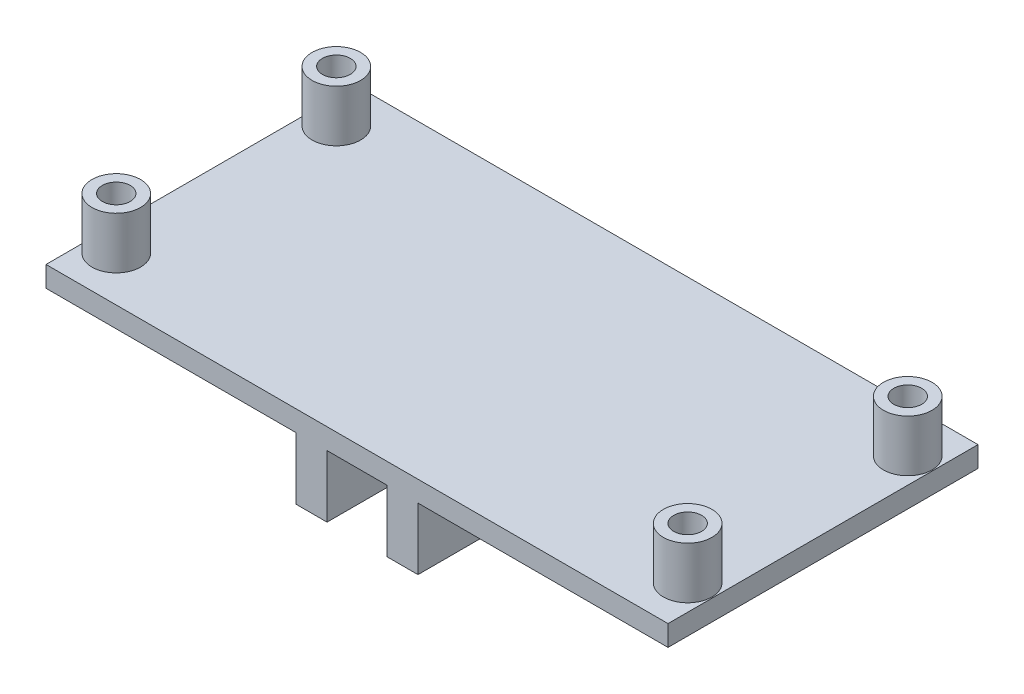
ISO-10303-21;
HEADER;
FILE_DESCRIPTION(('STEP AP214'),'2;1');
FILE_NAME('part.step','',(''),(''),'','','');
FILE_SCHEMA(('AUTOMOTIVE_DESIGN { 1 0 10303 214 1 1 1 1 }'));
ENDSEC;
DATA;
#1=APPLICATION_CONTEXT('core data for automotive mechanical design processes');
#2=APPLICATION_PROTOCOL_DEFINITION('international standard','automotive_design',2000,#1);
#3=PRODUCT_CONTEXT('',#1,'mechanical');
#4=PRODUCT('Part','Part','',(#3));
#5=PRODUCT_RELATED_PRODUCT_CATEGORY('part','',(#4));
#6=PRODUCT_DEFINITION_FORMATION('','',#4);
#7=PRODUCT_DEFINITION_CONTEXT('part definition',#1,'design');
#8=PRODUCT_DEFINITION('design','',#6,#7);
#9=PRODUCT_DEFINITION_SHAPE('','',#8);
#10=(LENGTH_UNIT() NAMED_UNIT(*) SI_UNIT(.MILLI.,.METRE.));
#11=(NAMED_UNIT(*) PLANE_ANGLE_UNIT() SI_UNIT($,.RADIAN.));
#12=(NAMED_UNIT(*) SI_UNIT($,.STERADIAN.) SOLID_ANGLE_UNIT());
#13=UNCERTAINTY_MEASURE_WITH_UNIT(LENGTH_MEASURE(1.E-05),#10,'distance_accuracy_value','');
#14=(GEOMETRIC_REPRESENTATION_CONTEXT(3) GLOBAL_UNCERTAINTY_ASSIGNED_CONTEXT((#13)) GLOBAL_UNIT_ASSIGNED_CONTEXT((#10,
#11,#12)) REPRESENTATION_CONTEXT('',''));
#15=CARTESIAN_POINT('',(0.,0.,0.));
#16=DIRECTION('',(0.,0.,1.));
#17=DIRECTION('',(1.,0.,0.));
#18=AXIS2_PLACEMENT_3D('',#15,#16,#17);
#19=CARTESIAN_POINT('',(0.,0.,0.));
#20=DIRECTION('',(0.,1.,0.));
#21=DIRECTION('',(0.,0.,1.));
#22=AXIS2_PLACEMENT_3D('',#19,#20,#21);
#23=PLANE('',#22);
#24=CARTESIAN_POINT('',(-27.65,0.,10.65));
#25=DIRECTION('',(0.,1.,0.));
#26=DIRECTION('',(0.,0.,-1.));
#27=AXIS2_PLACEMENT_3D('',#24,#25,#26);
#28=CIRCLE('',#27,1.35);
#29=CARTESIAN_POINT('',(-27.65,0.,9.3));
#30=VERTEX_POINT('',#29);
#31=EDGE_CURVE('E247',#30,#30,#28,.T.);
#32=ORIENTED_EDGE('',*,*,#31,.T.);
#33=EDGE_LOOP('',(#32));
#34=FACE_BOUND('',#33,.T.);
#35=CARTESIAN_POINT('',(-27.65,0.,-10.65));
#36=DIRECTION('',(0.,1.,0.));
#37=DIRECTION('',(0.,0.,1.));
#38=AXIS2_PLACEMENT_3D('',#35,#36,#37);
#39=CIRCLE('',#38,1.35);
#40=CARTESIAN_POINT('',(-27.65,0.,-9.3));
#41=VERTEX_POINT('',#40);
#42=EDGE_CURVE('E251',#41,#41,#39,.T.);
#43=ORIENTED_EDGE('',*,*,#42,.T.);
#44=EDGE_LOOP('',(#43));
#45=FACE_BOUND('',#44,.T.);
#46=DIRECTION('',(0.,0.,-1.));
#47=VECTOR('',#46,1.);
#48=CARTESIAN_POINT('',(-5.9,0.,-15.));
#49=LINE('',#48,#47);
#50=CARTESIAN_POINT('',(-5.9,0.,15.));
#51=VERTEX_POINT('',#50);
#52=CARTESIAN_POINT('',(-5.9,0.,-15.));
#53=VERTEX_POINT('',#52);
#54=EDGE_CURVE('E155',#51,#53,#49,.T.);
#55=ORIENTED_EDGE('',*,*,#54,.F.);
#56=DIRECTION('',(1.,0.,0.));
#57=VECTOR('',#56,1.);
#58=CARTESIAN_POINT('',(-30.1,0.,15.));
#59=LINE('',#58,#57);
#60=CARTESIAN_POINT('',(-30.1,0.,15.));
#61=VERTEX_POINT('',#60);
#62=EDGE_CURVE('E268',#61,#51,#59,.T.);
#63=ORIENTED_EDGE('',*,*,#62,.F.);
#64=DIRECTION('',(0.,0.,1.));
#65=VECTOR('',#64,1.);
#66=CARTESIAN_POINT('',(-30.1,0.,-15.));
#67=LINE('',#66,#65);
#68=CARTESIAN_POINT('',(-30.1,0.,-15.));
#69=VERTEX_POINT('',#68);
#70=EDGE_CURVE('E285',#69,#61,#67,.T.);
#71=ORIENTED_EDGE('',*,*,#70,.F.);
#72=DIRECTION('',(-1.,0.,0.));
#73=VECTOR('',#72,1.);
#74=CARTESIAN_POINT('',(-30.1,0.,-15.));
#75=LINE('',#74,#73);
#76=EDGE_CURVE('E281',#53,#69,#75,.T.);
#77=ORIENTED_EDGE('',*,*,#76,.F.);
#78=EDGE_LOOP('',(#55,#63,#71,#77));
#79=FACE_BOUND('',#78,.T.);
#80=ADVANCED_FACE('F39',(#34,#45,#79),#23,.F.);
#81=DIRECTION('',(0.,0.,1.));
#82=VECTOR('',#81,1.);
#83=CARTESIAN_POINT('',(-2.9,0.,-15.));
#84=LINE('',#83,#82);
#85=CARTESIAN_POINT('',(-2.9,0.,-15.));
#86=VERTEX_POINT('',#85);
#87=CARTESIAN_POINT('',(-2.90000000000001,0.,15.));
#88=VERTEX_POINT('',#87);
#89=EDGE_CURVE('E151',#86,#88,#84,.T.);
#90=ORIENTED_EDGE('',*,*,#89,.F.);
#91=CARTESIAN_POINT('',(2.9,0.,-15.));
#92=VERTEX_POINT('',#91);
#93=EDGE_CURVE('E286',#92,#86,#75,.T.);
#94=ORIENTED_EDGE('',*,*,#93,.F.);
#95=DIRECTION('',(0.,0.,-1.));
#96=VECTOR('',#95,1.);
#97=CARTESIAN_POINT('',(2.9,0.,-15.));
#98=LINE('',#97,#96);
#99=CARTESIAN_POINT('',(2.89999999999999,0.,15.));
#100=VERTEX_POINT('',#99);
#101=EDGE_CURVE('E161',#100,#92,#98,.T.);
#102=ORIENTED_EDGE('',*,*,#101,.F.);
#103=EDGE_CURVE('E293',#88,#100,#59,.T.);
#104=ORIENTED_EDGE('',*,*,#103,.F.);
#105=EDGE_LOOP('',(#90,#94,#102,#104));
#106=FACE_BOUND('',#105,.T.);
#107=ADVANCED_FACE('F368',(#106),#23,.F.);
#108=CARTESIAN_POINT('',(27.65,0.,10.65));
#109=DIRECTION('',(0.,1.,0.));
#110=DIRECTION('',(0.,0.,1.));
#111=AXIS2_PLACEMENT_3D('',#108,#109,#110);
#112=CIRCLE('',#111,1.35);
#113=CARTESIAN_POINT('',(27.65,0.,12.));
#114=VERTEX_POINT('',#113);
#115=EDGE_CURVE('E252',#114,#114,#112,.T.);
#116=ORIENTED_EDGE('',*,*,#115,.T.);
#117=EDGE_LOOP('',(#116));
#118=FACE_BOUND('',#117,.T.);
#119=CARTESIAN_POINT('',(27.65,0.,-10.65));
#120=DIRECTION('',(0.,1.,0.));
#121=DIRECTION('',(0.,0.,-1.));
#122=AXIS2_PLACEMENT_3D('',#119,#120,#121);
#123=CIRCLE('',#122,1.35);
#124=CARTESIAN_POINT('',(27.65,0.,-12.));
#125=VERTEX_POINT('',#124);
#126=EDGE_CURVE('E243',#125,#125,#123,.T.);
#127=ORIENTED_EDGE('',*,*,#126,.T.);
#128=EDGE_LOOP('',(#127));
#129=FACE_BOUND('',#128,.T.);
#130=DIRECTION('',(0.,0.,1.));
#131=VECTOR('',#130,1.);
#132=CARTESIAN_POINT('',(5.9,0.,-15.));
#133=LINE('',#132,#131);
#134=CARTESIAN_POINT('',(5.89999999999999,0.,-15.));
#135=VERTEX_POINT('',#134);
#136=CARTESIAN_POINT('',(5.89999999999999,0.,15.));
#137=VERTEX_POINT('',#136);
#138=EDGE_CURVE('E65',#135,#137,#133,.T.);
#139=ORIENTED_EDGE('',*,*,#138,.F.);
#140=CARTESIAN_POINT('',(30.1,0.,-15.));
#141=VERTEX_POINT('',#140);
#142=EDGE_CURVE('E282',#141,#135,#75,.T.);
#143=ORIENTED_EDGE('',*,*,#142,.F.);
#144=DIRECTION('',(0.,0.,-1.));
#145=VECTOR('',#144,1.);
#146=CARTESIAN_POINT('',(30.1,0.,-15.));
#147=LINE('',#146,#145);
#148=CARTESIAN_POINT('',(30.1,0.,15.));
#149=VERTEX_POINT('',#148);
#150=EDGE_CURVE('E262',#149,#141,#147,.T.);
#151=ORIENTED_EDGE('',*,*,#150,.F.);
#152=EDGE_CURVE('E289',#137,#149,#59,.T.);
#153=ORIENTED_EDGE('',*,*,#152,.F.);
#154=EDGE_LOOP('',(#139,#143,#151,#153));
#155=FACE_BOUND('',#154,.T.);
#156=ADVANCED_FACE('F371',(#118,#129,#155),#23,.F.);
#157=CARTESIAN_POINT('',(0.,2.,0.));
#158=DIRECTION('',(0.,1.,0.));
#159=DIRECTION('',(0.,0.,1.));
#160=AXIS2_PLACEMENT_3D('',#157,#158,#159);
#161=PLANE('',#160);
#162=CARTESIAN_POINT('',(27.65,2.,10.65));
#163=DIRECTION('',(0.,1.,0.));
#164=DIRECTION('',(0.,0.,1.));
#165=AXIS2_PLACEMENT_3D('',#162,#163,#164);
#166=CIRCLE('',#165,2.35);
#167=CARTESIAN_POINT('',(27.65,2.,13.));
#168=VERTEX_POINT('',#167);
#169=EDGE_CURVE('E214',#168,#168,#166,.T.);
#170=ORIENTED_EDGE('',*,*,#169,.F.);
#171=EDGE_LOOP('',(#170));
#172=FACE_BOUND('',#171,.T.);
#173=CARTESIAN_POINT('',(-27.65,2.,-10.65));
#174=DIRECTION('',(0.,1.,0.));
#175=DIRECTION('',(0.,0.,1.));
#176=AXIS2_PLACEMENT_3D('',#173,#174,#175);
#177=CIRCLE('',#176,2.35);
#178=CARTESIAN_POINT('',(-27.65,2.,-8.3));
#179=VERTEX_POINT('',#178);
#180=EDGE_CURVE('E238',#179,#179,#177,.T.);
#181=ORIENTED_EDGE('',*,*,#180,.F.);
#182=EDGE_LOOP('',(#181));
#183=FACE_BOUND('',#182,.T.);
#184=DIRECTION('',(0.,0.,-1.));
#185=VECTOR('',#184,1.);
#186=CARTESIAN_POINT('',(30.1,2.,-15.));
#187=LINE('',#186,#185);
#188=CARTESIAN_POINT('',(30.1,2.,15.));
#189=VERTEX_POINT('',#188);
#190=CARTESIAN_POINT('',(30.1,2.,-15.));
#191=VERTEX_POINT('',#190);
#192=EDGE_CURVE('E263',#189,#191,#187,.T.);
#193=ORIENTED_EDGE('',*,*,#192,.T.);
#194=DIRECTION('',(-1.,0.,0.));
#195=VECTOR('',#194,1.);
#196=CARTESIAN_POINT('',(-30.1,2.,-15.));
#197=LINE('',#196,#195);
#198=CARTESIAN_POINT('',(-30.1,2.,-15.));
#199=VERTEX_POINT('',#198);
#200=EDGE_CURVE('E267',#191,#199,#197,.T.);
#201=ORIENTED_EDGE('',*,*,#200,.T.);
#202=DIRECTION('',(0.,0.,1.));
#203=VECTOR('',#202,1.);
#204=CARTESIAN_POINT('',(-30.1,2.,-15.));
#205=LINE('',#204,#203);
#206=CARTESIAN_POINT('',(-30.1,2.,15.));
#207=VERTEX_POINT('',#206);
#208=EDGE_CURVE('E271',#199,#207,#205,.T.);
#209=ORIENTED_EDGE('',*,*,#208,.T.);
#210=DIRECTION('',(1.,0.,0.));
#211=VECTOR('',#210,1.);
#212=CARTESIAN_POINT('',(-30.1,2.,15.));
#213=LINE('',#212,#211);
#214=EDGE_CURVE('E274',#207,#189,#213,.T.);
#215=ORIENTED_EDGE('',*,*,#214,.T.);
#216=EDGE_LOOP('',(#193,#201,#209,#215));
#217=FACE_BOUND('',#216,.T.);
#218=CARTESIAN_POINT('',(27.65,2.,-10.65));
#219=DIRECTION('',(0.,1.,0.));
#220=DIRECTION('',(0.,0.,1.));
#221=AXIS2_PLACEMENT_3D('',#218,#219,#220);
#222=CIRCLE('',#221,2.35);
#223=CARTESIAN_POINT('',(27.65,2.,-8.30000000000001));
#224=VERTEX_POINT('',#223);
#225=EDGE_CURVE('E226',#224,#224,#222,.T.);
#226=ORIENTED_EDGE('',*,*,#225,.F.);
#227=EDGE_LOOP('',(#226));
#228=FACE_BOUND('',#227,.T.);
#229=CARTESIAN_POINT('',(-27.65,2.,10.65));
#230=DIRECTION('',(0.,1.,0.));
#231=DIRECTION('',(0.,0.,1.));
#232=AXIS2_PLACEMENT_3D('',#229,#230,#231);
#233=CIRCLE('',#232,2.35);
#234=CARTESIAN_POINT('',(-27.65,2.,13.));
#235=VERTEX_POINT('',#234);
#236=EDGE_CURVE('E202',#235,#235,#233,.T.);
#237=ORIENTED_EDGE('',*,*,#236,.F.);
#238=EDGE_LOOP('',(#237));
#239=FACE_BOUND('',#238,.T.);
#240=ADVANCED_FACE('F380',(#172,#183,#217,#228,#239),#161,.T.);
#241=CARTESIAN_POINT('',(30.1,2.,-15.));
#242=DIRECTION('',(-1.,0.,0.));
#243=DIRECTION('',(0.,0.,1.));
#244=AXIS2_PLACEMENT_3D('',#241,#242,#243);
#245=PLANE('',#244);
#246=ORIENTED_EDGE('',*,*,#150,.T.);
#247=DIRECTION('',(0.,-1.,0.));
#248=VECTOR('',#247,1.);
#249=CARTESIAN_POINT('',(30.1,2.,-15.));
#250=LINE('',#249,#248);
#251=EDGE_CURVE('E11',#191,#141,#250,.T.);
#252=ORIENTED_EDGE('',*,*,#251,.F.);
#253=ORIENTED_EDGE('',*,*,#192,.F.);
#254=DIRECTION('',(0.,-1.,0.));
#255=VECTOR('',#254,1.);
#256=CARTESIAN_POINT('',(30.1,2.,15.));
#257=LINE('',#256,#255);
#258=EDGE_CURVE('E277',#189,#149,#257,.T.);
#259=ORIENTED_EDGE('',*,*,#258,.T.);
#260=EDGE_LOOP('',(#246,#252,#253,#259));
#261=FACE_BOUND('',#260,.T.);
#262=ADVANCED_FACE('F41',(#261),#245,.F.);
#263=CARTESIAN_POINT('',(-30.1,2.,-15.));
#264=DIRECTION('',(0.,0.,1.));
#265=DIRECTION('',(1.,0.,0.));
#266=AXIS2_PLACEMENT_3D('',#263,#264,#265);
#267=PLANE('',#266);
#268=ORIENTED_EDGE('',*,*,#142,.T.);
#269=DIRECTION('',(0.,1.,0.));
#270=VECTOR('',#269,1.);
#271=CARTESIAN_POINT('',(5.9,-6.,-15.));
#272=LINE('',#271,#270);
#273=CARTESIAN_POINT('',(5.9,-6.,-15.));
#274=VERTEX_POINT('',#273);
#275=EDGE_CURVE('E178',#274,#135,#272,.T.);
#276=ORIENTED_EDGE('',*,*,#275,.F.);
#277=DIRECTION('',(1.,0.,0.));
#278=VECTOR('',#277,1.);
#279=CARTESIAN_POINT('',(5.9,-6.,-15.));
#280=LINE('',#279,#278);
#281=CARTESIAN_POINT('',(2.9,-6.,-15.));
#282=VERTEX_POINT('',#281);
#283=EDGE_CURVE('E176',#282,#274,#280,.T.);
#284=ORIENTED_EDGE('',*,*,#283,.F.);
#285=DIRECTION('',(0.,1.,0.));
#286=VECTOR('',#285,1.);
#287=CARTESIAN_POINT('',(2.9,-6.,-15.));
#288=LINE('',#287,#286);
#289=EDGE_CURVE('E186',#282,#92,#288,.T.);
#290=ORIENTED_EDGE('',*,*,#289,.T.);
#291=ORIENTED_EDGE('',*,*,#93,.T.);
#292=DIRECTION('',(0.,1.,0.));
#293=VECTOR('',#292,1.);
#294=CARTESIAN_POINT('',(-2.9,-6.,-15.));
#295=LINE('',#294,#293);
#296=CARTESIAN_POINT('',(-2.9,-6.,-15.));
#297=VERTEX_POINT('',#296);
#298=EDGE_CURVE('E138',#297,#86,#295,.T.);
#299=ORIENTED_EDGE('',*,*,#298,.F.);
#300=DIRECTION('',(1.,0.,0.));
#301=VECTOR('',#300,1.);
#302=CARTESIAN_POINT('',(-5.9,-6.,-15.));
#303=LINE('',#302,#301);
#304=CARTESIAN_POINT('',(-5.9,-6.,-15.));
#305=VERTEX_POINT('',#304);
#306=EDGE_CURVE('E131',#305,#297,#303,.T.);
#307=ORIENTED_EDGE('',*,*,#306,.F.);
#308=DIRECTION('',(0.,1.,0.));
#309=VECTOR('',#308,1.);
#310=CARTESIAN_POINT('',(-5.9,-6.,-15.));
#311=LINE('',#310,#309);
#312=EDGE_CURVE('E135',#305,#53,#311,.T.);
#313=ORIENTED_EDGE('',*,*,#312,.T.);
#314=ORIENTED_EDGE('',*,*,#76,.T.);
#315=DIRECTION('',(0.,-1.,0.));
#316=VECTOR('',#315,1.);
#317=CARTESIAN_POINT('',(-30.1,2.,-15.));
#318=LINE('',#317,#316);
#319=EDGE_CURVE('E49',#199,#69,#318,.T.);
#320=ORIENTED_EDGE('',*,*,#319,.F.);
#321=ORIENTED_EDGE('',*,*,#200,.F.);
#322=ORIENTED_EDGE('',*,*,#251,.T.);
#323=EDGE_LOOP('',(#268,#276,#284,#290,#291,#299,#307,#313,#314,#320,#321,#322));
#324=FACE_BOUND('',#323,.T.);
#325=ADVANCED_FACE('F133',(#324),#267,.F.);
#326=CARTESIAN_POINT('',(-30.1,2.,-15.));
#327=DIRECTION('',(1.,0.,0.));
#328=DIRECTION('',(0.,0.,-1.));
#329=AXIS2_PLACEMENT_3D('',#326,#327,#328);
#330=PLANE('',#329);
#331=ORIENTED_EDGE('',*,*,#70,.T.);
#332=DIRECTION('',(0.,-1.,0.));
#333=VECTOR('',#332,1.);
#334=CARTESIAN_POINT('',(-30.1,2.,15.));
#335=LINE('',#334,#333);
#336=EDGE_CURVE('E297',#207,#61,#335,.T.);
#337=ORIENTED_EDGE('',*,*,#336,.F.);
#338=ORIENTED_EDGE('',*,*,#208,.F.);
#339=ORIENTED_EDGE('',*,*,#319,.T.);
#340=EDGE_LOOP('',(#331,#337,#338,#339));
#341=FACE_BOUND('',#340,.T.);
#342=ADVANCED_FACE('F434',(#341),#330,.F.);
#343=CARTESIAN_POINT('',(-30.1,2.,15.));
#344=DIRECTION('',(0.,0.,-1.));
#345=DIRECTION('',(-1.,0.,0.));
#346=AXIS2_PLACEMENT_3D('',#343,#344,#345);
#347=PLANE('',#346);
#348=ORIENTED_EDGE('',*,*,#62,.T.);
#349=DIRECTION('',(0.,1.,0.));
#350=VECTOR('',#349,1.);
#351=CARTESIAN_POINT('',(-5.9,-6.,15.));
#352=LINE('',#351,#350);
#353=CARTESIAN_POINT('',(-5.9,-6.,15.));
#354=VERTEX_POINT('',#353);
#355=EDGE_CURVE('E339',#354,#51,#352,.T.);
#356=ORIENTED_EDGE('',*,*,#355,.F.);
#357=DIRECTION('',(-1.,0.,0.));
#358=VECTOR('',#357,1.);
#359=CARTESIAN_POINT('',(-5.9,-6.,15.));
#360=LINE('',#359,#358);
#361=CARTESIAN_POINT('',(-2.9,-6.,15.));
#362=VERTEX_POINT('',#361);
#363=EDGE_CURVE('E147',#362,#354,#360,.T.);
#364=ORIENTED_EDGE('',*,*,#363,.F.);
#365=DIRECTION('',(0.,1.,0.));
#366=VECTOR('',#365,1.);
#367=CARTESIAN_POINT('',(-2.9,-6.,15.));
#368=LINE('',#367,#366);
#369=EDGE_CURVE('E57',#362,#88,#368,.T.);
#370=ORIENTED_EDGE('',*,*,#369,.T.);
#371=ORIENTED_EDGE('',*,*,#103,.T.);
#372=DIRECTION('',(0.,1.,0.));
#373=VECTOR('',#372,1.);
#374=CARTESIAN_POINT('',(2.9,-6.,15.));
#375=LINE('',#374,#373);
#376=CARTESIAN_POINT('',(2.9,-6.,15.));
#377=VERTEX_POINT('',#376);
#378=EDGE_CURVE('E190',#377,#100,#375,.T.);
#379=ORIENTED_EDGE('',*,*,#378,.F.);
#380=DIRECTION('',(-1.,0.,0.));
#381=VECTOR('',#380,1.);
#382=CARTESIAN_POINT('',(5.9,-6.,15.));
#383=LINE('',#382,#381);
#384=CARTESIAN_POINT('',(5.9,-6.,15.));
#385=VERTEX_POINT('',#384);
#386=EDGE_CURVE('E170',#385,#377,#383,.T.);
#387=ORIENTED_EDGE('',*,*,#386,.F.);
#388=DIRECTION('',(0.,1.,0.));
#389=VECTOR('',#388,1.);
#390=CARTESIAN_POINT('',(5.9,-6.,15.));
#391=LINE('',#390,#389);
#392=EDGE_CURVE('E194',#385,#137,#391,.T.);
#393=ORIENTED_EDGE('',*,*,#392,.T.);
#394=ORIENTED_EDGE('',*,*,#152,.T.);
#395=ORIENTED_EDGE('',*,*,#258,.F.);
#396=ORIENTED_EDGE('',*,*,#214,.F.);
#397=ORIENTED_EDGE('',*,*,#336,.T.);
#398=EDGE_LOOP('',(#348,#356,#364,#370,#371,#379,#387,#393,#394,#395,#396,#397));
#399=FACE_BOUND('',#398,.T.);
#400=ADVANCED_FACE('F429',(#399),#347,.F.);
#401=CARTESIAN_POINT('',(-27.65,0.,-10.65));
#402=DIRECTION('',(0.,1.,0.));
#403=DIRECTION('',(0.,0.,1.));
#404=AXIS2_PLACEMENT_3D('',#401,#402,#403);
#405=CYLINDRICAL_SURFACE('',#404,1.35);
#406=ORIENTED_EDGE('',*,*,#42,.F.);
#407=EDGE_LOOP('',(#406));
#408=FACE_BOUND('',#407,.T.);
#409=CARTESIAN_POINT('',(-27.65,7.,-10.65));
#410=DIRECTION('',(0.,1.,0.));
#411=DIRECTION('',(0.,0.,1.));
#412=AXIS2_PLACEMENT_3D('',#409,#410,#411);
#413=CIRCLE('',#412,1.35);
#414=CARTESIAN_POINT('',(-27.65,7.,-9.3));
#415=VERTEX_POINT('',#414);
#416=EDGE_CURVE('E231',#415,#415,#413,.T.);
#417=ORIENTED_EDGE('',*,*,#416,.T.);
#418=EDGE_LOOP('',(#417));
#419=FACE_BOUND('',#418,.T.);
#420=ADVANCED_FACE('F423',(#408,#419),#405,.F.);
#421=CARTESIAN_POINT('',(-27.65,0.,10.65));
#422=DIRECTION('',(0.,1.,0.));
#423=DIRECTION('',(0.,0.,1.));
#424=AXIS2_PLACEMENT_3D('',#421,#422,#423);
#425=CYLINDRICAL_SURFACE('',#424,1.35);
#426=ORIENTED_EDGE('',*,*,#31,.F.);
#427=EDGE_LOOP('',(#426));
#428=FACE_BOUND('',#427,.T.);
#429=CARTESIAN_POINT('',(-27.65,7.,10.65));
#430=DIRECTION('',(0.,1.,0.));
#431=DIRECTION('',(0.,0.,1.));
#432=AXIS2_PLACEMENT_3D('',#429,#430,#431);
#433=CIRCLE('',#432,1.35);
#434=CARTESIAN_POINT('',(-27.65,7.,12.));
#435=VERTEX_POINT('',#434);
#436=EDGE_CURVE('E198',#435,#435,#433,.T.);
#437=ORIENTED_EDGE('',*,*,#436,.T.);
#438=EDGE_LOOP('',(#437));
#439=FACE_BOUND('',#438,.T.);
#440=ADVANCED_FACE('F420',(#428,#439),#425,.F.);
#441=CARTESIAN_POINT('',(27.65,0.,10.65));
#442=DIRECTION('',(0.,1.,0.));
#443=DIRECTION('',(0.,0.,1.));
#444=AXIS2_PLACEMENT_3D('',#441,#442,#443);
#445=CYLINDRICAL_SURFACE('',#444,1.35);
#446=ORIENTED_EDGE('',*,*,#115,.F.);
#447=EDGE_LOOP('',(#446));
#448=FACE_BOUND('',#447,.T.);
#449=CARTESIAN_POINT('',(27.65,7.,10.65));
#450=DIRECTION('',(0.,1.,0.));
#451=DIRECTION('',(0.,0.,1.));
#452=AXIS2_PLACEMENT_3D('',#449,#450,#451);
#453=CIRCLE('',#452,1.35);
#454=CARTESIAN_POINT('',(27.65,7.,12.));
#455=VERTEX_POINT('',#454);
#456=EDGE_CURVE('E207',#455,#455,#453,.T.);
#457=ORIENTED_EDGE('',*,*,#456,.T.);
#458=EDGE_LOOP('',(#457));
#459=FACE_BOUND('',#458,.T.);
#460=ADVANCED_FACE('F394',(#448,#459),#445,.F.);
#461=CARTESIAN_POINT('',(27.65,0.,-10.65));
#462=DIRECTION('',(0.,1.,0.));
#463=DIRECTION('',(0.,0.,1.));
#464=AXIS2_PLACEMENT_3D('',#461,#462,#463);
#465=CYLINDRICAL_SURFACE('',#464,1.35);
#466=ORIENTED_EDGE('',*,*,#126,.F.);
#467=EDGE_LOOP('',(#466));
#468=FACE_BOUND('',#467,.T.);
#469=CARTESIAN_POINT('',(27.65,7.,-10.65));
#470=DIRECTION('',(0.,1.,0.));
#471=DIRECTION('',(0.,0.,1.));
#472=AXIS2_PLACEMENT_3D('',#469,#470,#471);
#473=CIRCLE('',#472,1.35);
#474=CARTESIAN_POINT('',(27.65,7.,-9.30000000000001));
#475=VERTEX_POINT('',#474);
#476=EDGE_CURVE('E219',#475,#475,#473,.T.);
#477=ORIENTED_EDGE('',*,*,#476,.T.);
#478=EDGE_LOOP('',(#477));
#479=FACE_BOUND('',#478,.T.);
#480=ADVANCED_FACE('F390',(#468,#479),#465,.F.);
#481=CARTESIAN_POINT('',(-27.65,7.,-10.65));
#482=DIRECTION('',(0.,1.,0.));
#483=DIRECTION('',(0.,0.,1.));
#484=AXIS2_PLACEMENT_3D('',#481,#482,#483);
#485=PLANE('',#484);
#486=CARTESIAN_POINT('',(-27.65,7.,-10.65));
#487=DIRECTION('',(0.,1.,0.));
#488=DIRECTION('',(0.,0.,1.));
#489=AXIS2_PLACEMENT_3D('',#486,#487,#488);
#490=CIRCLE('',#489,2.35);
#491=CARTESIAN_POINT('',(-27.65,7.,-8.3));
#492=VERTEX_POINT('',#491);
#493=EDGE_CURVE('E239',#492,#492,#490,.T.);
#494=ORIENTED_EDGE('',*,*,#493,.T.);
#495=EDGE_LOOP('',(#494));
#496=FACE_BOUND('',#495,.T.);
#497=ORIENTED_EDGE('',*,*,#416,.F.);
#498=EDGE_LOOP('',(#497));
#499=FACE_BOUND('',#498,.T.);
#500=ADVANCED_FACE('F393',(#496,#499),#485,.T.);
#501=CARTESIAN_POINT('',(-27.65,7.,-10.65));
#502=DIRECTION('',(0.,-1.,0.));
#503=DIRECTION('',(0.,0.,-1.));
#504=AXIS2_PLACEMENT_3D('',#501,#502,#503);
#505=CYLINDRICAL_SURFACE('',#504,2.35);
#506=ORIENTED_EDGE('',*,*,#493,.F.);
#507=EDGE_LOOP('',(#506));
#508=FACE_BOUND('',#507,.T.);
#509=ORIENTED_EDGE('',*,*,#180,.T.);
#510=EDGE_LOOP('',(#509));
#511=FACE_BOUND('',#510,.T.);
#512=ADVANCED_FACE('F401',(#508,#511),#505,.T.);
#513=CARTESIAN_POINT('',(27.65,7.,-10.65));
#514=DIRECTION('',(0.,1.,0.));
#515=DIRECTION('',(0.,0.,1.));
#516=AXIS2_PLACEMENT_3D('',#513,#514,#515);
#517=PLANE('',#516);
#518=CARTESIAN_POINT('',(27.65,7.,-10.65));
#519=DIRECTION('',(0.,1.,0.));
#520=DIRECTION('',(0.,0.,1.));
#521=AXIS2_PLACEMENT_3D('',#518,#519,#520);
#522=CIRCLE('',#521,2.35);
#523=CARTESIAN_POINT('',(27.65,7.,-8.30000000000001));
#524=VERTEX_POINT('',#523);
#525=EDGE_CURVE('E227',#524,#524,#522,.T.);
#526=ORIENTED_EDGE('',*,*,#525,.T.);
#527=EDGE_LOOP('',(#526));
#528=FACE_BOUND('',#527,.T.);
#529=ORIENTED_EDGE('',*,*,#476,.F.);
#530=EDGE_LOOP('',(#529));
#531=FACE_BOUND('',#530,.T.);
#532=ADVANCED_FACE('F398',(#528,#531),#517,.T.);
#533=CARTESIAN_POINT('',(27.65,7.,-10.65));
#534=DIRECTION('',(0.,-1.,0.));
#535=DIRECTION('',(0.,0.,-1.));
#536=AXIS2_PLACEMENT_3D('',#533,#534,#535);
#537=CYLINDRICAL_SURFACE('',#536,2.35);
#538=ORIENTED_EDGE('',*,*,#525,.F.);
#539=EDGE_LOOP('',(#538));
#540=FACE_BOUND('',#539,.T.);
#541=ORIENTED_EDGE('',*,*,#225,.T.);
#542=EDGE_LOOP('',(#541));
#543=FACE_BOUND('',#542,.T.);
#544=ADVANCED_FACE('F400',(#540,#543),#537,.T.);
#545=CARTESIAN_POINT('',(27.65,7.,10.65));
#546=DIRECTION('',(0.,1.,0.));
#547=DIRECTION('',(0.,0.,1.));
#548=AXIS2_PLACEMENT_3D('',#545,#546,#547);
#549=PLANE('',#548);
#550=CARTESIAN_POINT('',(27.65,7.,10.65));
#551=DIRECTION('',(0.,1.,0.));
#552=DIRECTION('',(0.,0.,1.));
#553=AXIS2_PLACEMENT_3D('',#550,#551,#552);
#554=CIRCLE('',#553,2.35);
#555=CARTESIAN_POINT('',(27.65,7.,13.));
#556=VERTEX_POINT('',#555);
#557=EDGE_CURVE('E215',#556,#556,#554,.T.);
#558=ORIENTED_EDGE('',*,*,#557,.T.);
#559=EDGE_LOOP('',(#558));
#560=FACE_BOUND('',#559,.T.);
#561=ORIENTED_EDGE('',*,*,#456,.F.);
#562=EDGE_LOOP('',(#561));
#563=FACE_BOUND('',#562,.T.);
#564=ADVANCED_FACE('F408',(#560,#563),#549,.T.);
#565=CARTESIAN_POINT('',(27.65,7.,10.65));
#566=DIRECTION('',(0.,-1.,0.));
#567=DIRECTION('',(0.,0.,-1.));
#568=AXIS2_PLACEMENT_3D('',#565,#566,#567);
#569=CYLINDRICAL_SURFACE('',#568,2.35);
#570=ORIENTED_EDGE('',*,*,#557,.F.);
#571=EDGE_LOOP('',(#570));
#572=FACE_BOUND('',#571,.T.);
#573=ORIENTED_EDGE('',*,*,#169,.T.);
#574=EDGE_LOOP('',(#573));
#575=FACE_BOUND('',#574,.T.);
#576=ADVANCED_FACE('F414',(#572,#575),#569,.T.);
#577=CARTESIAN_POINT('',(-27.65,7.,10.65));
#578=DIRECTION('',(0.,1.,0.));
#579=DIRECTION('',(0.,0.,1.));
#580=AXIS2_PLACEMENT_3D('',#577,#578,#579);
#581=PLANE('',#580);
#582=CARTESIAN_POINT('',(-27.65,7.,10.65));
#583=DIRECTION('',(0.,1.,0.));
#584=DIRECTION('',(0.,0.,1.));
#585=AXIS2_PLACEMENT_3D('',#582,#583,#584);
#586=CIRCLE('',#585,2.35);
#587=CARTESIAN_POINT('',(-27.65,7.,13.));
#588=VERTEX_POINT('',#587);
#589=EDGE_CURVE('E203',#588,#588,#586,.T.);
#590=ORIENTED_EDGE('',*,*,#589,.T.);
#591=EDGE_LOOP('',(#590));
#592=FACE_BOUND('',#591,.T.);
#593=ORIENTED_EDGE('',*,*,#436,.F.);
#594=EDGE_LOOP('',(#593));
#595=FACE_BOUND('',#594,.T.);
#596=ADVANCED_FACE('F488',(#592,#595),#581,.T.);
#597=CARTESIAN_POINT('',(-27.65,7.,10.65));
#598=DIRECTION('',(0.,-1.,0.));
#599=DIRECTION('',(0.,0.,-1.));
#600=AXIS2_PLACEMENT_3D('',#597,#598,#599);
#601=CYLINDRICAL_SURFACE('',#600,2.35);
#602=ORIENTED_EDGE('',*,*,#589,.F.);
#603=EDGE_LOOP('',(#602));
#604=FACE_BOUND('',#603,.T.);
#605=ORIENTED_EDGE('',*,*,#236,.T.);
#606=EDGE_LOOP('',(#605));
#607=FACE_BOUND('',#606,.T.);
#608=ADVANCED_FACE('F486',(#604,#607),#601,.T.);
#609=CARTESIAN_POINT('',(5.9,-6.,-15.));
#610=DIRECTION('',(-1.,0.,0.));
#611=DIRECTION('',(0.,0.,1.));
#612=AXIS2_PLACEMENT_3D('',#609,#610,#611);
#613=PLANE('',#612);
#614=CARTESIAN_POINT('',(5.9,-3.75,-7.));
#615=DIRECTION('',(-1.,0.,0.));
#616=DIRECTION('',(0.,0.,1.));
#617=AXIS2_PLACEMENT_3D('',#614,#615,#616);
#618=CIRCLE('',#617,1.5);
#619=CARTESIAN_POINT('',(5.9,-3.75,-5.5));
#620=VERTEX_POINT('',#619);
#621=EDGE_CURVE('E331',#620,#620,#618,.T.);
#622=ORIENTED_EDGE('',*,*,#621,.T.);
#623=EDGE_LOOP('',(#622));
#624=FACE_BOUND('',#623,.T.);
#625=CARTESIAN_POINT('',(5.9,-3.75,7.35));
#626=DIRECTION('',(-1.,0.,0.));
#627=DIRECTION('',(0.,0.,1.));
#628=AXIS2_PLACEMENT_3D('',#625,#626,#627);
#629=CIRCLE('',#628,1.5);
#630=CARTESIAN_POINT('',(5.9,-3.75,8.85));
#631=VERTEX_POINT('',#630);
#632=EDGE_CURVE('E313',#631,#631,#629,.T.);
#633=ORIENTED_EDGE('',*,*,#632,.T.);
#634=EDGE_LOOP('',(#633));
#635=FACE_BOUND('',#634,.T.);
#636=ORIENTED_EDGE('',*,*,#138,.T.);
#637=ORIENTED_EDGE('',*,*,#392,.F.);
#638=DIRECTION('',(0.,0.,1.));
#639=VECTOR('',#638,1.);
#640=CARTESIAN_POINT('',(5.9,-6.,-15.));
#641=LINE('',#640,#639);
#642=EDGE_CURVE('E166',#274,#385,#641,.T.);
#643=ORIENTED_EDGE('',*,*,#642,.F.);
#644=ORIENTED_EDGE('',*,*,#275,.T.);
#645=EDGE_LOOP('',(#636,#637,#643,#644));
#646=FACE_BOUND('',#645,.T.);
#647=ADVANCED_FACE('F469',(#624,#635,#646),#613,.F.);
#648=CARTESIAN_POINT('',(2.9,-6.,-15.));
#649=DIRECTION('',(1.,0.,0.));
#650=DIRECTION('',(0.,0.,-1.));
#651=AXIS2_PLACEMENT_3D('',#648,#649,#650);
#652=PLANE('',#651);
#653=CARTESIAN_POINT('',(2.9,-3.75,-7.));
#654=DIRECTION('',(1.,0.,0.));
#655=DIRECTION('',(0.,0.,-1.));
#656=AXIS2_PLACEMENT_3D('',#653,#654,#655);
#657=CIRCLE('',#656,1.5);
#658=CARTESIAN_POINT('',(2.9,-3.75,-8.5));
#659=VERTEX_POINT('',#658);
#660=EDGE_CURVE('E327',#659,#659,#657,.T.);
#661=ORIENTED_EDGE('',*,*,#660,.T.);
#662=EDGE_LOOP('',(#661));
#663=FACE_BOUND('',#662,.T.);
#664=CARTESIAN_POINT('',(2.9,-3.75,7.35));
#665=DIRECTION('',(1.,0.,0.));
#666=DIRECTION('',(0.,0.,-1.));
#667=AXIS2_PLACEMENT_3D('',#664,#665,#666);
#668=CIRCLE('',#667,1.5);
#669=CARTESIAN_POINT('',(2.9,-3.75,5.85));
#670=VERTEX_POINT('',#669);
#671=EDGE_CURVE('E306',#670,#670,#668,.T.);
#672=ORIENTED_EDGE('',*,*,#671,.T.);
#673=EDGE_LOOP('',(#672));
#674=FACE_BOUND('',#673,.T.);
#675=ORIENTED_EDGE('',*,*,#101,.T.);
#676=ORIENTED_EDGE('',*,*,#289,.F.);
#677=DIRECTION('',(0.,0.,-1.));
#678=VECTOR('',#677,1.);
#679=CARTESIAN_POINT('',(2.9,-6.,-15.));
#680=LINE('',#679,#678);
#681=EDGE_CURVE('E173',#377,#282,#680,.T.);
#682=ORIENTED_EDGE('',*,*,#681,.F.);
#683=ORIENTED_EDGE('',*,*,#378,.T.);
#684=EDGE_LOOP('',(#675,#676,#682,#683));
#685=FACE_BOUND('',#684,.T.);
#686=ADVANCED_FACE('F456',(#663,#674,#685),#652,.F.);
#687=CARTESIAN_POINT('',(0.,-6.,0.));
#688=DIRECTION('',(0.,-1.,0.));
#689=DIRECTION('',(0.,0.,-1.));
#690=AXIS2_PLACEMENT_3D('',#687,#688,#689);
#691=PLANE('',#690);
#692=ORIENTED_EDGE('',*,*,#642,.T.);
#693=ORIENTED_EDGE('',*,*,#386,.T.);
#694=ORIENTED_EDGE('',*,*,#681,.T.);
#695=ORIENTED_EDGE('',*,*,#283,.T.);
#696=EDGE_LOOP('',(#692,#693,#694,#695));
#697=FACE_BOUND('',#696,.T.);
#698=ADVANCED_FACE('F471',(#697),#691,.T.);
#699=CARTESIAN_POINT('',(-5.9,-6.,-15.));
#700=DIRECTION('',(1.,0.,0.));
#701=DIRECTION('',(0.,0.,-1.));
#702=AXIS2_PLACEMENT_3D('',#699,#700,#701);
#703=PLANE('',#702);
#704=CARTESIAN_POINT('',(-5.9,-3.75,-7.));
#705=DIRECTION('',(-1.,0.,0.));
#706=DIRECTION('',(0.,0.,1.));
#707=AXIS2_PLACEMENT_3D('',#704,#705,#706);
#708=CIRCLE('',#707,1.5);
#709=CARTESIAN_POINT('',(-5.9,-3.75,-5.5));
#710=VERTEX_POINT('',#709);
#711=EDGE_CURVE('E307',#710,#710,#708,.T.);
#712=ORIENTED_EDGE('',*,*,#711,.F.);
#713=EDGE_LOOP('',(#712));
#714=FACE_BOUND('',#713,.T.);
#715=CARTESIAN_POINT('',(-5.9,-3.75,7.35));
#716=DIRECTION('',(-1.,0.,0.));
#717=DIRECTION('',(0.,0.,1.));
#718=AXIS2_PLACEMENT_3D('',#715,#716,#717);
#719=CIRCLE('',#718,1.5);
#720=CARTESIAN_POINT('',(-5.9,-3.75,8.85));
#721=VERTEX_POINT('',#720);
#722=EDGE_CURVE('E316',#721,#721,#719,.T.);
#723=ORIENTED_EDGE('',*,*,#722,.F.);
#724=EDGE_LOOP('',(#723));
#725=FACE_BOUND('',#724,.T.);
#726=ORIENTED_EDGE('',*,*,#54,.T.);
#727=ORIENTED_EDGE('',*,*,#312,.F.);
#728=DIRECTION('',(0.,0.,-1.));
#729=VECTOR('',#728,1.);
#730=CARTESIAN_POINT('',(-5.9,-6.,-15.));
#731=LINE('',#730,#729);
#732=EDGE_CURVE('E143',#354,#305,#731,.T.);
#733=ORIENTED_EDGE('',*,*,#732,.F.);
#734=ORIENTED_EDGE('',*,*,#355,.T.);
#735=EDGE_LOOP('',(#726,#727,#733,#734));
#736=FACE_BOUND('',#735,.T.);
#737=ADVANCED_FACE('F153',(#714,#725,#736),#703,.F.);
#738=CARTESIAN_POINT('',(-2.9,-6.,-15.));
#739=DIRECTION('',(-1.,0.,0.));
#740=DIRECTION('',(0.,0.,1.));
#741=AXIS2_PLACEMENT_3D('',#738,#739,#740);
#742=PLANE('',#741);
#743=CARTESIAN_POINT('',(-2.9,-3.75,-7.));
#744=DIRECTION('',(-1.,0.,0.));
#745=DIRECTION('',(0.,0.,1.));
#746=AXIS2_PLACEMENT_3D('',#743,#744,#745);
#747=CIRCLE('',#746,1.5);
#748=CARTESIAN_POINT('',(-2.9,-3.75,-5.5));
#749=VERTEX_POINT('',#748);
#750=EDGE_CURVE('E43',#749,#749,#747,.T.);
#751=ORIENTED_EDGE('',*,*,#750,.T.);
#752=EDGE_LOOP('',(#751));
#753=FACE_BOUND('',#752,.T.);
#754=CARTESIAN_POINT('',(-2.9,-3.75,7.35));
#755=DIRECTION('',(-1.,0.,0.));
#756=DIRECTION('',(0.,0.,1.));
#757=AXIS2_PLACEMENT_3D('',#754,#755,#756);
#758=CIRCLE('',#757,1.5);
#759=CARTESIAN_POINT('',(-2.9,-3.75,8.85));
#760=VERTEX_POINT('',#759);
#761=EDGE_CURVE('E303',#760,#760,#758,.T.);
#762=ORIENTED_EDGE('',*,*,#761,.T.);
#763=EDGE_LOOP('',(#762));
#764=FACE_BOUND('',#763,.T.);
#765=ORIENTED_EDGE('',*,*,#89,.T.);
#766=ORIENTED_EDGE('',*,*,#369,.F.);
#767=DIRECTION('',(0.,0.,1.));
#768=VECTOR('',#767,1.);
#769=CARTESIAN_POINT('',(-2.9,-6.,-15.));
#770=LINE('',#769,#768);
#771=EDGE_CURVE('E142',#297,#362,#770,.T.);
#772=ORIENTED_EDGE('',*,*,#771,.F.);
#773=ORIENTED_EDGE('',*,*,#298,.T.);
#774=EDGE_LOOP('',(#765,#766,#772,#773));
#775=FACE_BOUND('',#774,.T.);
#776=ADVANCED_FACE('F350',(#753,#764,#775),#742,.F.);
#777=CARTESIAN_POINT('',(0.,-6.,0.));
#778=DIRECTION('',(0.,1.,0.));
#779=DIRECTION('',(0.,0.,1.));
#780=AXIS2_PLACEMENT_3D('',#777,#778,#779);
#781=PLANE('',#780);
#782=ORIENTED_EDGE('',*,*,#732,.T.);
#783=ORIENTED_EDGE('',*,*,#306,.T.);
#784=ORIENTED_EDGE('',*,*,#771,.T.);
#785=ORIENTED_EDGE('',*,*,#363,.T.);
#786=EDGE_LOOP('',(#782,#783,#784,#785));
#787=FACE_BOUND('',#786,.T.);
#788=ADVANCED_FACE('F146',(#787),#781,.F.);
#789=CARTESIAN_POINT('',(30.1,-3.75,7.35));
#790=DIRECTION('',(-1.,0.,0.));
#791=DIRECTION('',(0.,0.,1.));
#792=AXIS2_PLACEMENT_3D('',#789,#790,#791);
#793=CYLINDRICAL_SURFACE('',#792,1.5);
#794=ORIENTED_EDGE('',*,*,#722,.T.);
#795=EDGE_LOOP('',(#794));
#796=FACE_BOUND('',#795,.T.);
#797=ORIENTED_EDGE('',*,*,#761,.F.);
#798=EDGE_LOOP('',(#797));
#799=FACE_BOUND('',#798,.T.);
#800=ADVANCED_FACE('F355',(#796,#799),#793,.F.);
#801=CARTESIAN_POINT('',(30.1,-3.75,-7.));
#802=DIRECTION('',(-1.,0.,0.));
#803=DIRECTION('',(0.,0.,1.));
#804=AXIS2_PLACEMENT_3D('',#801,#802,#803);
#805=CYLINDRICAL_SURFACE('',#804,1.5);
#806=ORIENTED_EDGE('',*,*,#711,.T.);
#807=EDGE_LOOP('',(#806));
#808=FACE_BOUND('',#807,.T.);
#809=ORIENTED_EDGE('',*,*,#750,.F.);
#810=EDGE_LOOP('',(#809));
#811=FACE_BOUND('',#810,.T.);
#812=ADVANCED_FACE('F352',(#808,#811),#805,.F.);
#813=ORIENTED_EDGE('',*,*,#671,.F.);
#814=EDGE_LOOP('',(#813));
#815=FACE_BOUND('',#814,.T.);
#816=ORIENTED_EDGE('',*,*,#632,.F.);
#817=EDGE_LOOP('',(#816));
#818=FACE_BOUND('',#817,.T.);
#819=ADVANCED_FACE('F354',(#815,#818),#793,.F.);
#820=ORIENTED_EDGE('',*,*,#660,.F.);
#821=EDGE_LOOP('',(#820));
#822=FACE_BOUND('',#821,.T.);
#823=ORIENTED_EDGE('',*,*,#621,.F.);
#824=EDGE_LOOP('',(#823));
#825=FACE_BOUND('',#824,.T.);
#826=ADVANCED_FACE('F357',(#822,#825),#805,.F.);
#827=CLOSED_SHELL('',(#80,#107,#156,#240,#262,#325,#342,#400,#420,#440,#460,#480,#500,#512,#532,
#544,#564,#576,#596,#608,#647,#686,#698,#737,#776,#788,#800,#812,#819,#826));
#828=MANIFOLD_SOLID_BREP('B2',#827);
#829=ADVANCED_BREP_SHAPE_REPRESENTATION('',(#18,#828),#14);
#830=SHAPE_DEFINITION_REPRESENTATION(#9,#829);
ENDSEC;
END-ISO-10303-21;
